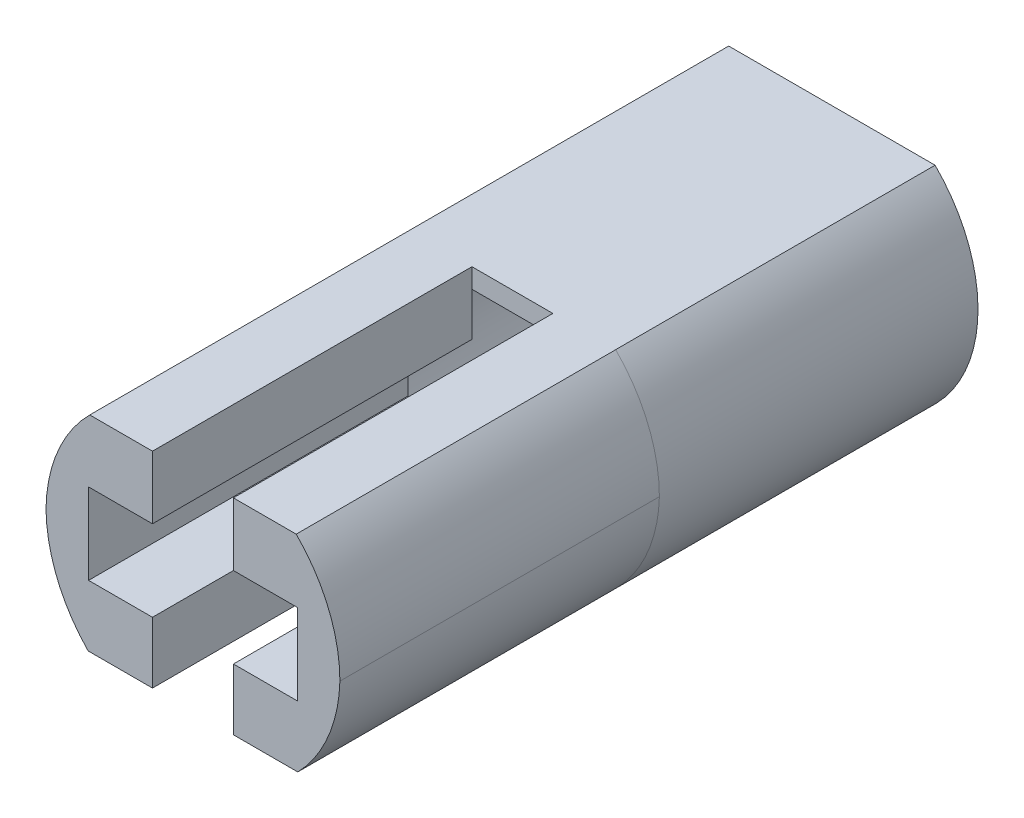
ISO-10303-21;
HEADER;
FILE_DESCRIPTION(('STEP AP214'),'2;1');
FILE_NAME('part.step','',(''),(''),'','','');
FILE_SCHEMA(('AUTOMOTIVE_DESIGN { 1 0 10303 214 1 1 1 1 }'));
ENDSEC;
DATA;
#1=APPLICATION_CONTEXT('core data for automotive mechanical design processes');
#2=APPLICATION_PROTOCOL_DEFINITION('international standard','automotive_design',2000,#1);
#3=PRODUCT_CONTEXT('',#1,'mechanical');
#4=PRODUCT('Part','Part','',(#3));
#5=PRODUCT_RELATED_PRODUCT_CATEGORY('part','',(#4));
#6=PRODUCT_DEFINITION_FORMATION('','',#4);
#7=PRODUCT_DEFINITION_CONTEXT('part definition',#1,'design');
#8=PRODUCT_DEFINITION('design','',#6,#7);
#9=PRODUCT_DEFINITION_SHAPE('','',#8);
#10=(LENGTH_UNIT() NAMED_UNIT(*) SI_UNIT(.MILLI.,.METRE.));
#11=(NAMED_UNIT(*) PLANE_ANGLE_UNIT() SI_UNIT($,.RADIAN.));
#12=(NAMED_UNIT(*) SI_UNIT($,.STERADIAN.) SOLID_ANGLE_UNIT());
#13=UNCERTAINTY_MEASURE_WITH_UNIT(LENGTH_MEASURE(1.E-05),#10,'distance_accuracy_value','');
#14=(GEOMETRIC_REPRESENTATION_CONTEXT(3) GLOBAL_UNCERTAINTY_ASSIGNED_CONTEXT((#13)) GLOBAL_UNIT_ASSIGNED_CONTEXT((#10,
#11,#12)) REPRESENTATION_CONTEXT('',''));
#15=CARTESIAN_POINT('',(0.,0.,0.));
#16=DIRECTION('',(0.,0.,1.));
#17=DIRECTION('',(1.,0.,0.));
#18=AXIS2_PLACEMENT_3D('',#15,#16,#17);
#19=CARTESIAN_POINT('',(0.,0.,7.5));
#20=DIRECTION('',(0.,0.,-1.));
#21=DIRECTION('',(-1.,0.,0.));
#22=AXIS2_PLACEMENT_3D('',#19,#20,#21);
#23=PLANE('',#22);
#24=CARTESIAN_POINT('',(3.4,3.40142886309282,7.5));
#25=DIRECTION('',(0.,0.,-1.));
#26=DIRECTION('',(-1.,0.,0.));
#27=AXIS2_PLACEMENT_3D('',#24,#25,#26);
#28=CIRCLE('',#27,3.5);
#29=CARTESIAN_POINT('',(6.9,3.40142886309282,7.5));
#30=VERTEX_POINT('',#29);
#31=CARTESIAN_POINT('',(5.87422905852766,5.87694710498427,7.5));
#32=VERTEX_POINT('',#31);
#33=EDGE_CURVE('E265',#30,#32,#28,.F.);
#34=ORIENTED_EDGE('',*,*,#33,.T.);
#35=DIRECTION('',(-1.,0.,0.));
#36=VECTOR('',#35,1.);
#37=CARTESIAN_POINT('',(3.45526077848229,5.87694710498427,7.5));
#38=LINE('',#37,#36);
#39=CARTESIAN_POINT('',(4.4,5.87694710498427,7.5));
#40=VERTEX_POINT('',#39);
#41=EDGE_CURVE('E316',#32,#40,#38,.T.);
#42=ORIENTED_EDGE('',*,*,#41,.T.);
#43=DIRECTION('',(0.,1.,0.));
#44=VECTOR('',#43,1.);
#45=CARTESIAN_POINT('',(4.4,5.9,7.5));
#46=LINE('',#45,#44);
#47=CARTESIAN_POINT('',(4.4,4.4,7.5));
#48=VERTEX_POINT('',#47);
#49=EDGE_CURVE('E386',#48,#40,#46,.T.);
#50=ORIENTED_EDGE('',*,*,#49,.F.);
#51=DIRECTION('',(-1.,0.,0.));
#52=VECTOR('',#51,1.);
#53=CARTESIAN_POINT('',(4.4,4.4,7.5));
#54=LINE('',#53,#52);
#55=CARTESIAN_POINT('',(5.9,4.4,7.5));
#56=VERTEX_POINT('',#55);
#57=EDGE_CURVE('E384',#56,#48,#54,.T.);
#58=ORIENTED_EDGE('',*,*,#57,.F.);
#59=DIRECTION('',(0.,1.,0.));
#60=VECTOR('',#59,1.);
#61=CARTESIAN_POINT('',(5.9,2.5,7.5));
#62=LINE('',#61,#60);
#63=CARTESIAN_POINT('',(5.9,2.5,7.5));
#64=VERTEX_POINT('',#63);
#65=EDGE_CURVE('E376',#64,#56,#62,.T.);
#66=ORIENTED_EDGE('',*,*,#65,.F.);
#67=DIRECTION('',(1.,0.,0.));
#68=VECTOR('',#67,1.);
#69=CARTESIAN_POINT('',(4.4,2.5,7.5));
#70=LINE('',#69,#68);
#71=CARTESIAN_POINT('',(4.4,2.5,7.5));
#72=VERTEX_POINT('',#71);
#73=EDGE_CURVE('E370',#72,#64,#70,.T.);
#74=ORIENTED_EDGE('',*,*,#73,.F.);
#75=DIRECTION('',(0.,1.,0.));
#76=VECTOR('',#75,1.);
#77=CARTESIAN_POINT('',(4.4,1.,7.5));
#78=LINE('',#77,#76);
#79=CARTESIAN_POINT('',(4.4,1.06,7.5));
#80=VERTEX_POINT('',#79);
#81=EDGE_CURVE('E368',#80,#72,#78,.T.);
#82=ORIENTED_EDGE('',*,*,#81,.F.);
#83=DIRECTION('',(1.,0.,0.));
#84=VECTOR('',#83,1.);
#85=CARTESIAN_POINT('',(0.,1.06,7.5));
#86=LINE('',#85,#84);
#87=CARTESIAN_POINT('',(5.91065115373723,1.06,7.5));
#88=VERTEX_POINT('',#87);
#89=EDGE_CURVE('E303',#80,#88,#86,.T.);
#90=ORIENTED_EDGE('',*,*,#89,.T.);
#91=CARTESIAN_POINT('',(3.40138831377805,3.5,7.5));
#92=DIRECTION('',(0.,0.,-1.));
#93=DIRECTION('',(-1.,0.,0.));
#94=AXIS2_PLACEMENT_3D('',#91,#92,#93);
#95=CIRCLE('',#94,3.5);
#96=EDGE_CURVE('E264',#88,#30,#95,.F.);
#97=ORIENTED_EDGE('',*,*,#96,.T.);
#98=EDGE_LOOP('',(#34,#42,#50,#58,#66,#74,#82,#90,#97));
#99=FACE_BOUND('',#98,.T.);
#100=ADVANCED_FACE('F33',(#99),#23,.F.);
#101=CARTESIAN_POINT('',(3.45,3.44930527176794,-7.5));
#102=DIRECTION('',(0.,0.,1.));
#103=DIRECTION('',(1.,0.,0.));
#104=AXIS2_PLACEMENT_3D('',#101,#102,#103);
#105=CYLINDRICAL_SURFACE('',#104,3.4297788505925);
#106=DIRECTION('',(0.,0.,1.));
#107=VECTOR('',#106,1.);
#108=CARTESIAN_POINT('',(5.87279551212843,5.87694710498427,-7.5));
#109=LINE('',#108,#107);
#110=CARTESIAN_POINT('',(5.87279551212843,5.87694710498427,0.));
#111=VERTEX_POINT('',#110);
#112=CARTESIAN_POINT('',(5.87279551212843,5.87694710498427,-7.5));
#113=VERTEX_POINT('',#112);
#114=EDGE_CURVE('E213',#111,#113,#109,.F.);
#115=ORIENTED_EDGE('',*,*,#114,.F.);
#116=CARTESIAN_POINT('',(3.45,3.44930527176794,0.));
#117=DIRECTION('',(0.,0.,1.));
#118=DIRECTION('',(1.,0.,0.));
#119=AXIS2_PLACEMENT_3D('',#116,#117,#118);
#120=CIRCLE('',#119,3.4297788505925);
#121=CARTESIAN_POINT('',(5.91063075062364,1.06,0.));
#122=VERTEX_POINT('',#121);
#123=EDGE_CURVE('E254',#122,#111,#120,.T.);
#124=ORIENTED_EDGE('',*,*,#123,.F.);
#125=DIRECTION('',(0.,0.,1.));
#126=VECTOR('',#125,1.);
#127=CARTESIAN_POINT('',(5.91061034751005,1.06,-7.5));
#128=LINE('',#127,#126);
#129=CARTESIAN_POINT('',(5.91061034751005,1.06,-7.5));
#130=VERTEX_POINT('',#129);
#131=EDGE_CURVE('E234',#130,#122,#128,.T.);
#132=ORIENTED_EDGE('',*,*,#131,.F.);
#133=CARTESIAN_POINT('',(3.45,3.44930527176794,-7.5));
#134=DIRECTION('',(0.,0.,1.));
#135=DIRECTION('',(1.,0.,0.));
#136=AXIS2_PLACEMENT_3D('',#133,#134,#135);
#137=CIRCLE('',#136,3.4297788505925);
#138=EDGE_CURVE('E229',#130,#113,#137,.T.);
#139=ORIENTED_EDGE('',*,*,#138,.T.);
#140=EDGE_LOOP('',(#115,#124,#132,#139));
#141=FACE_BOUND('',#140,.T.);
#142=ADVANCED_FACE('F233',(#141),#105,.T.);
#143=CARTESIAN_POINT('',(0.,0.,0.));
#144=DIRECTION('',(0.,0.,-1.));
#145=DIRECTION('',(-1.,0.,0.));
#146=AXIS2_PLACEMENT_3D('',#143,#144,#145);
#147=PLANE('',#146);
#148=DIRECTION('',(1.,0.,0.));
#149=VECTOR('',#148,1.);
#150=CARTESIAN_POINT('',(5.51038370012373,1.48021436267703,0.));
#151=LINE('',#150,#149);
#152=CARTESIAN_POINT('',(4.4,1.48021436267703,0.));
#153=VERTEX_POINT('',#152);
#154=CARTESIAN_POINT('',(5.51038370012373,1.48021436267703,0.));
#155=VERTEX_POINT('',#154);
#156=EDGE_CURVE('E259',#153,#155,#151,.T.);
#157=ORIENTED_EDGE('',*,*,#156,.F.);
#158=DIRECTION('',(0.,1.,0.));
#159=VECTOR('',#158,1.);
#160=CARTESIAN_POINT('',(4.4,1.,0.));
#161=LINE('',#160,#159);
#162=CARTESIAN_POINT('',(4.4,2.5,0.));
#163=VERTEX_POINT('',#162);
#164=EDGE_CURVE('E402',#153,#163,#161,.T.);
#165=ORIENTED_EDGE('',*,*,#164,.T.);
#166=DIRECTION('',(1.,0.,0.));
#167=VECTOR('',#166,1.);
#168=CARTESIAN_POINT('',(4.4,2.5,0.));
#169=LINE('',#168,#167);
#170=CARTESIAN_POINT('',(5.9,2.5,0.));
#171=VERTEX_POINT('',#170);
#172=EDGE_CURVE('E405',#163,#171,#169,.T.);
#173=ORIENTED_EDGE('',*,*,#172,.T.);
#174=DIRECTION('',(0.,1.,0.));
#175=VECTOR('',#174,1.);
#176=CARTESIAN_POINT('',(5.9,2.5,0.));
#177=LINE('',#176,#175);
#178=CARTESIAN_POINT('',(5.9,4.4,0.));
#179=VERTEX_POINT('',#178);
#180=EDGE_CURVE('E408',#171,#179,#177,.T.);
#181=ORIENTED_EDGE('',*,*,#180,.T.);
#182=DIRECTION('',(-1.,0.,0.));
#183=VECTOR('',#182,1.);
#184=CARTESIAN_POINT('',(4.4,4.4,0.));
#185=LINE('',#184,#183);
#186=CARTESIAN_POINT('',(4.4,4.4,0.));
#187=VERTEX_POINT('',#186);
#188=EDGE_CURVE('E411',#179,#187,#185,.T.);
#189=ORIENTED_EDGE('',*,*,#188,.T.);
#190=DIRECTION('',(0.,1.,0.));
#191=VECTOR('',#190,1.);
#192=CARTESIAN_POINT('',(4.4,5.9,0.));
#193=LINE('',#192,#191);
#194=CARTESIAN_POINT('',(4.4,5.41839618085885,0.));
#195=VERTEX_POINT('',#194);
#196=EDGE_CURVE('E415',#187,#195,#193,.T.);
#197=ORIENTED_EDGE('',*,*,#196,.T.);
#198=DIRECTION('',(-1.,0.,0.));
#199=VECTOR('',#198,1.);
#200=CARTESIAN_POINT('',(5.51038370012373,5.41839618085885,0.));
#201=LINE('',#200,#199);
#202=CARTESIAN_POINT('',(5.51038370012373,5.41839618085885,0.));
#203=VERTEX_POINT('',#202);
#204=EDGE_CURVE('E452',#203,#195,#201,.T.);
#205=ORIENTED_EDGE('',*,*,#204,.F.);
#206=CARTESIAN_POINT('',(3.45,3.44930527176794,0.));
#207=DIRECTION('',(0.,0.,1.));
#208=DIRECTION('',(1.,0.,0.));
#209=AXIS2_PLACEMENT_3D('',#206,#207,#208);
#210=CIRCLE('',#209,2.85);
#211=EDGE_CURVE('E295',#155,#203,#210,.T.);
#212=ORIENTED_EDGE('',*,*,#211,.F.);
#213=EDGE_LOOP('',(#157,#165,#173,#181,#189,#197,#205,#212));
#214=FACE_BOUND('',#213,.T.);
#215=ADVANCED_FACE('F496',(#214),#147,.T.);
#216=CARTESIAN_POINT('',(1.38961629987627,1.48021436267703,0.));
#217=VERTEX_POINT('',#216);
#218=CARTESIAN_POINT('',(2.5,1.48021436267703,0.));
#219=VERTEX_POINT('',#218);
#220=EDGE_CURVE('E456',#217,#219,#151,.T.);
#221=ORIENTED_EDGE('',*,*,#220,.F.);
#222=CARTESIAN_POINT('',(3.45,3.44930527176794,0.));
#223=DIRECTION('',(0.,0.,1.));
#224=DIRECTION('',(1.,0.,0.));
#225=AXIS2_PLACEMENT_3D('',#222,#223,#224);
#226=CIRCLE('',#225,2.85);
#227=CARTESIAN_POINT('',(1.38961629987628,5.41839618085885,0.));
#228=VERTEX_POINT('',#227);
#229=EDGE_CURVE('E447',#228,#217,#226,.T.);
#230=ORIENTED_EDGE('',*,*,#229,.F.);
#231=CARTESIAN_POINT('',(2.5,5.41839618085885,0.));
#232=VERTEX_POINT('',#231);
#233=EDGE_CURVE('E256',#232,#228,#201,.T.);
#234=ORIENTED_EDGE('',*,*,#233,.F.);
#235=DIRECTION('',(0.,-1.,0.));
#236=VECTOR('',#235,1.);
#237=CARTESIAN_POINT('',(2.5,4.4,0.));
#238=LINE('',#237,#236);
#239=CARTESIAN_POINT('',(2.5,4.4,0.));
#240=VERTEX_POINT('',#239);
#241=EDGE_CURVE('E235',#232,#240,#238,.T.);
#242=ORIENTED_EDGE('',*,*,#241,.T.);
#243=DIRECTION('',(-1.,0.,0.));
#244=VECTOR('',#243,1.);
#245=CARTESIAN_POINT('',(1.,4.4,0.));
#246=LINE('',#245,#244);
#247=CARTESIAN_POINT('',(1.,4.4,0.));
#248=VERTEX_POINT('',#247);
#249=EDGE_CURVE('E389',#240,#248,#246,.T.);
#250=ORIENTED_EDGE('',*,*,#249,.T.);
#251=DIRECTION('',(0.,-1.,0.));
#252=VECTOR('',#251,1.);
#253=CARTESIAN_POINT('',(1.,2.5,0.));
#254=LINE('',#253,#252);
#255=CARTESIAN_POINT('',(1.,2.5,0.));
#256=VERTEX_POINT('',#255);
#257=EDGE_CURVE('E392',#248,#256,#254,.T.);
#258=ORIENTED_EDGE('',*,*,#257,.T.);
#259=DIRECTION('',(1.,0.,0.));
#260=VECTOR('',#259,1.);
#261=CARTESIAN_POINT('',(1.,2.5,0.));
#262=LINE('',#261,#260);
#263=CARTESIAN_POINT('',(2.5,2.5,0.));
#264=VERTEX_POINT('',#263);
#265=EDGE_CURVE('E395',#256,#264,#262,.T.);
#266=ORIENTED_EDGE('',*,*,#265,.T.);
#267=DIRECTION('',(0.,-1.,0.));
#268=VECTOR('',#267,1.);
#269=CARTESIAN_POINT('',(2.5,1.,0.));
#270=LINE('',#269,#268);
#271=EDGE_CURVE('E399',#264,#219,#270,.T.);
#272=ORIENTED_EDGE('',*,*,#271,.T.);
#273=EDGE_LOOP('',(#221,#230,#234,#242,#250,#258,#266,#272));
#274=FACE_BOUND('',#273,.T.);
#275=ADVANCED_FACE('F443',(#274),#147,.T.);
#276=CARTESIAN_POINT('',(3.5,3.4,0.));
#277=DIRECTION('',(0.,0.,-1.));
#278=DIRECTION('',(-1.,0.,0.));
#279=AXIS2_PLACEMENT_3D('',#276,#277,#278);
#280=CIRCLE('',#279,3.5);
#281=CARTESIAN_POINT('',(0.000347304349202458,3.44930527176794,0.));
#282=VERTEX_POINT('',#281);
#283=CARTESIAN_POINT('',(1.00787331912706,5.85749966561162,0.));
#284=VERTEX_POINT('',#283);
#285=EDGE_CURVE('E337',#282,#284,#280,.T.);
#286=ORIENTED_EDGE('',*,*,#285,.T.);
#287=CARTESIAN_POINT('',(0.989389652489952,1.06,0.));
#288=VERTEX_POINT('',#287);
#289=EDGE_CURVE('E239',#284,#288,#120,.T.);
#290=ORIENTED_EDGE('',*,*,#289,.T.);
#291=CARTESIAN_POINT('',(3.5,3.49861054353589,0.));
#292=DIRECTION('',(0.,0.,-1.));
#293=DIRECTION('',(-1.,0.,0.));
#294=AXIS2_PLACEMENT_3D('',#291,#292,#293);
#295=CIRCLE('',#294,3.5);
#296=EDGE_CURVE('E273',#288,#282,#295,.T.);
#297=ORIENTED_EDGE('',*,*,#296,.T.);
#298=EDGE_LOOP('',(#286,#290,#297));
#299=FACE_BOUND('',#298,.T.);
#300=ADVANCED_FACE('F539',(#299),#147,.T.);
#301=DIRECTION('',(0.,-1.,0.));
#302=VECTOR('',#301,1.);
#303=CARTESIAN_POINT('',(2.5,4.4,7.5));
#304=LINE('',#303,#302);
#305=CARTESIAN_POINT('',(2.5,5.87694710498427,7.5));
#306=VERTEX_POINT('',#305);
#307=CARTESIAN_POINT('',(2.5,4.4,7.5));
#308=VERTEX_POINT('',#307);
#309=EDGE_CURVE('E246',#306,#308,#304,.T.);
#310=ORIENTED_EDGE('',*,*,#309,.F.);
#311=CARTESIAN_POINT('',(1.02720137513989,5.87694710498427,7.5));
#312=VERTEX_POINT('',#311);
#313=EDGE_CURVE('E230',#306,#312,#38,.T.);
#314=ORIENTED_EDGE('',*,*,#313,.T.);
#315=CARTESIAN_POINT('',(3.5,3.4,7.5));
#316=DIRECTION('',(0.,0.,-1.));
#317=DIRECTION('',(-1.,0.,0.));
#318=AXIS2_PLACEMENT_3D('',#315,#316,#317);
#319=CIRCLE('',#318,3.5);
#320=CARTESIAN_POINT('',(0.000347304349202458,3.44930527176794,7.5));
#321=VERTEX_POINT('',#320);
#322=EDGE_CURVE('E326',#312,#321,#319,.F.);
#323=ORIENTED_EDGE('',*,*,#322,.T.);
#324=CARTESIAN_POINT('',(3.5,3.49861054353589,7.5));
#325=DIRECTION('',(0.,0.,-1.));
#326=DIRECTION('',(-1.,0.,0.));
#327=AXIS2_PLACEMENT_3D('',#324,#325,#326);
#328=CIRCLE('',#327,3.5);
#329=CARTESIAN_POINT('',(0.989386804592229,1.06,7.5));
#330=VERTEX_POINT('',#329);
#331=EDGE_CURVE('E266',#321,#330,#328,.F.);
#332=ORIENTED_EDGE('',*,*,#331,.T.);
#333=CARTESIAN_POINT('',(2.5,1.06,7.5));
#334=VERTEX_POINT('',#333);
#335=EDGE_CURVE('E298',#330,#334,#86,.T.);
#336=ORIENTED_EDGE('',*,*,#335,.T.);
#337=DIRECTION('',(0.,-1.,0.));
#338=VECTOR('',#337,1.);
#339=CARTESIAN_POINT('',(2.5,1.,7.5));
#340=LINE('',#339,#338);
#341=CARTESIAN_POINT('',(2.5,2.5,7.5));
#342=VERTEX_POINT('',#341);
#343=EDGE_CURVE('E374',#342,#334,#340,.T.);
#344=ORIENTED_EDGE('',*,*,#343,.F.);
#345=DIRECTION('',(1.,0.,0.));
#346=VECTOR('',#345,1.);
#347=CARTESIAN_POINT('',(1.,2.5,7.5));
#348=LINE('',#347,#346);
#349=CARTESIAN_POINT('',(1.,2.5,7.5));
#350=VERTEX_POINT('',#349);
#351=EDGE_CURVE('E379',#350,#342,#348,.T.);
#352=ORIENTED_EDGE('',*,*,#351,.F.);
#353=DIRECTION('',(0.,-1.,0.));
#354=VECTOR('',#353,1.);
#355=CARTESIAN_POINT('',(1.,2.5,7.5));
#356=LINE('',#355,#354);
#357=CARTESIAN_POINT('',(1.,4.4,7.5));
#358=VERTEX_POINT('',#357);
#359=EDGE_CURVE('E782',#358,#350,#356,.T.);
#360=ORIENTED_EDGE('',*,*,#359,.F.);
#361=DIRECTION('',(-1.,0.,0.));
#362=VECTOR('',#361,1.);
#363=CARTESIAN_POINT('',(1.,4.4,7.5));
#364=LINE('',#363,#362);
#365=EDGE_CURVE('E789',#308,#358,#364,.T.);
#366=ORIENTED_EDGE('',*,*,#365,.F.);
#367=EDGE_LOOP('',(#310,#314,#323,#332,#336,#344,#352,#360,#366));
#368=FACE_BOUND('',#367,.T.);
#369=ADVANCED_FACE('F324',(#368),#23,.F.);
#370=DIRECTION('',(-1.,0.,0.));
#371=VECTOR('',#370,1.);
#372=CARTESIAN_POINT('',(0.,5.87694710498427,0.));
#373=LINE('',#372,#371);
#374=CARTESIAN_POINT('',(5.87422905852766,5.87694710498427,0.));
#375=VERTEX_POINT('',#374);
#376=EDGE_CURVE('E218',#375,#111,#373,.T.);
#377=ORIENTED_EDGE('',*,*,#376,.F.);
#378=CARTESIAN_POINT('',(3.4,3.40142886309282,0.));
#379=DIRECTION('',(0.,0.,-1.));
#380=DIRECTION('',(-1.,0.,0.));
#381=AXIS2_PLACEMENT_3D('',#378,#379,#380);
#382=CIRCLE('',#381,3.5);
#383=CARTESIAN_POINT('',(6.9,3.40142886309282,0.));
#384=VERTEX_POINT('',#383);
#385=EDGE_CURVE('E336',#375,#384,#382,.T.);
#386=ORIENTED_EDGE('',*,*,#385,.T.);
#387=CARTESIAN_POINT('',(3.40138831377805,3.5,0.));
#388=DIRECTION('',(0.,0.,-1.));
#389=DIRECTION('',(-1.,0.,0.));
#390=AXIS2_PLACEMENT_3D('',#387,#388,#389);
#391=CIRCLE('',#390,3.5);
#392=EDGE_CURVE('E260',#384,#122,#391,.T.);
#393=ORIENTED_EDGE('',*,*,#392,.T.);
#394=ORIENTED_EDGE('',*,*,#123,.T.);
#395=EDGE_LOOP('',(#377,#386,#393,#394));
#396=FACE_BOUND('',#395,.T.);
#397=ADVANCED_FACE('F360',(#396),#147,.T.);
#398=CARTESIAN_POINT('',(2.5,4.4,7.5));
#399=DIRECTION('',(1.,0.,0.));
#400=DIRECTION('',(0.,0.,-1.));
#401=AXIS2_PLACEMENT_3D('',#398,#399,#400);
#402=PLANE('',#401);
#403=DIRECTION('',(0.,0.,-1.));
#404=VECTOR('',#403,1.);
#405=CARTESIAN_POINT('',(2.5,5.87694710498427,7.5));
#406=LINE('',#405,#404);
#407=CARTESIAN_POINT('',(2.5,5.87694710498427,0.));
#408=VERTEX_POINT('',#407);
#409=EDGE_CURVE('E49',#306,#408,#406,.T.);
#410=ORIENTED_EDGE('',*,*,#409,.F.);
#411=ORIENTED_EDGE('',*,*,#309,.T.);
#412=DIRECTION('',(0.,0.,-1.));
#413=VECTOR('',#412,1.);
#414=CARTESIAN_POINT('',(2.5,4.4,7.5));
#415=LINE('',#414,#413);
#416=EDGE_CURVE('E342',#308,#240,#415,.T.);
#417=ORIENTED_EDGE('',*,*,#416,.T.);
#418=ORIENTED_EDGE('',*,*,#241,.F.);
#419=EDGE_CURVE('E237',#408,#232,#238,.T.);
#420=ORIENTED_EDGE('',*,*,#419,.F.);
#421=EDGE_LOOP('',(#410,#411,#417,#418,#420));
#422=FACE_BOUND('',#421,.T.);
#423=ADVANCED_FACE('F435',(#422),#402,.T.);
#424=CARTESIAN_POINT('',(1.,4.4,7.5));
#425=DIRECTION('',(0.,-1.,0.));
#426=DIRECTION('',(0.,0.,-1.));
#427=AXIS2_PLACEMENT_3D('',#424,#425,#426);
#428=PLANE('',#427);
#429=ORIENTED_EDGE('',*,*,#249,.F.);
#430=ORIENTED_EDGE('',*,*,#416,.F.);
#431=ORIENTED_EDGE('',*,*,#365,.T.);
#432=DIRECTION('',(0.,0.,-1.));
#433=VECTOR('',#432,1.);
#434=CARTESIAN_POINT('',(1.,4.4,7.5));
#435=LINE('',#434,#433);
#436=EDGE_CURVE('E429',#358,#248,#435,.T.);
#437=ORIENTED_EDGE('',*,*,#436,.T.);
#438=EDGE_LOOP('',(#429,#430,#431,#437));
#439=FACE_BOUND('',#438,.T.);
#440=ADVANCED_FACE('F439',(#439),#428,.T.);
#441=CARTESIAN_POINT('',(1.,2.5,7.5));
#442=DIRECTION('',(1.,0.,0.));
#443=DIRECTION('',(0.,0.,-1.));
#444=AXIS2_PLACEMENT_3D('',#441,#442,#443);
#445=PLANE('',#444);
#446=ORIENTED_EDGE('',*,*,#257,.F.);
#447=ORIENTED_EDGE('',*,*,#436,.F.);
#448=ORIENTED_EDGE('',*,*,#359,.T.);
#449=DIRECTION('',(0.,0.,-1.));
#450=VECTOR('',#449,1.);
#451=CARTESIAN_POINT('',(1.,2.5,7.5));
#452=LINE('',#451,#450);
#453=EDGE_CURVE('E427',#350,#256,#452,.T.);
#454=ORIENTED_EDGE('',*,*,#453,.T.);
#455=EDGE_LOOP('',(#446,#447,#448,#454));
#456=FACE_BOUND('',#455,.T.);
#457=ADVANCED_FACE('F585',(#456),#445,.T.);
#458=CARTESIAN_POINT('',(1.,2.5,7.5));
#459=DIRECTION('',(0.,1.,0.));
#460=DIRECTION('',(0.,0.,1.));
#461=AXIS2_PLACEMENT_3D('',#458,#459,#460);
#462=PLANE('',#461);
#463=ORIENTED_EDGE('',*,*,#265,.F.);
#464=ORIENTED_EDGE('',*,*,#453,.F.);
#465=ORIENTED_EDGE('',*,*,#351,.T.);
#466=DIRECTION('',(0.,0.,-1.));
#467=VECTOR('',#466,1.);
#468=CARTESIAN_POINT('',(2.5,2.5,7.5));
#469=LINE('',#468,#467);
#470=EDGE_CURVE('E425',#342,#264,#469,.T.);
#471=ORIENTED_EDGE('',*,*,#470,.T.);
#472=EDGE_LOOP('',(#463,#464,#465,#471));
#473=FACE_BOUND('',#472,.T.);
#474=ADVANCED_FACE('F581',(#473),#462,.T.);
#475=CARTESIAN_POINT('',(2.5,1.,7.5));
#476=DIRECTION('',(1.,0.,0.));
#477=DIRECTION('',(0.,0.,-1.));
#478=AXIS2_PLACEMENT_3D('',#475,#476,#477);
#479=PLANE('',#478);
#480=DIRECTION('',(0.,0.,1.));
#481=VECTOR('',#480,1.);
#482=CARTESIAN_POINT('',(2.5,1.06,7.5));
#483=LINE('',#482,#481);
#484=CARTESIAN_POINT('',(2.5,1.06,0.));
#485=VERTEX_POINT('',#484);
#486=EDGE_CURVE('E293',#485,#334,#483,.T.);
#487=ORIENTED_EDGE('',*,*,#486,.F.);
#488=EDGE_CURVE('E398',#219,#485,#270,.T.);
#489=ORIENTED_EDGE('',*,*,#488,.F.);
#490=ORIENTED_EDGE('',*,*,#271,.F.);
#491=ORIENTED_EDGE('',*,*,#470,.F.);
#492=ORIENTED_EDGE('',*,*,#343,.T.);
#493=EDGE_LOOP('',(#487,#489,#490,#491,#492));
#494=FACE_BOUND('',#493,.T.);
#495=ADVANCED_FACE('F578',(#494),#479,.T.);
#496=CARTESIAN_POINT('',(4.4,1.,7.5));
#497=DIRECTION('',(-1.,0.,0.));
#498=DIRECTION('',(0.,0.,1.));
#499=AXIS2_PLACEMENT_3D('',#496,#497,#498);
#500=PLANE('',#499);
#501=DIRECTION('',(0.,0.,-1.));
#502=VECTOR('',#501,1.);
#503=CARTESIAN_POINT('',(4.4,1.06,7.5));
#504=LINE('',#503,#502);
#505=CARTESIAN_POINT('',(4.4,1.06,0.));
#506=VERTEX_POINT('',#505);
#507=EDGE_CURVE('E291',#80,#506,#504,.T.);
#508=ORIENTED_EDGE('',*,*,#507,.F.);
#509=ORIENTED_EDGE('',*,*,#81,.T.);
#510=DIRECTION('',(0.,0.,-1.));
#511=VECTOR('',#510,1.);
#512=CARTESIAN_POINT('',(4.4,2.5,7.5));
#513=LINE('',#512,#511);
#514=EDGE_CURVE('E423',#72,#163,#513,.T.);
#515=ORIENTED_EDGE('',*,*,#514,.T.);
#516=ORIENTED_EDGE('',*,*,#164,.F.);
#517=EDGE_CURVE('E403',#506,#153,#161,.T.);
#518=ORIENTED_EDGE('',*,*,#517,.F.);
#519=EDGE_LOOP('',(#508,#509,#515,#516,#518));
#520=FACE_BOUND('',#519,.T.);
#521=ADVANCED_FACE('F498',(#520),#500,.T.);
#522=CARTESIAN_POINT('',(4.4,2.5,7.5));
#523=DIRECTION('',(0.,1.,0.));
#524=DIRECTION('',(0.,0.,1.));
#525=AXIS2_PLACEMENT_3D('',#522,#523,#524);
#526=PLANE('',#525);
#527=ORIENTED_EDGE('',*,*,#172,.F.);
#528=ORIENTED_EDGE('',*,*,#514,.F.);
#529=ORIENTED_EDGE('',*,*,#73,.T.);
#530=DIRECTION('',(0.,0.,-1.));
#531=VECTOR('',#530,1.);
#532=CARTESIAN_POINT('',(5.9,2.5,7.5));
#533=LINE('',#532,#531);
#534=EDGE_CURVE('E421',#64,#171,#533,.T.);
#535=ORIENTED_EDGE('',*,*,#534,.T.);
#536=EDGE_LOOP('',(#527,#528,#529,#535));
#537=FACE_BOUND('',#536,.T.);
#538=ADVANCED_FACE('F501',(#537),#526,.T.);
#539=CARTESIAN_POINT('',(5.9,2.5,7.5));
#540=DIRECTION('',(-1.,0.,0.));
#541=DIRECTION('',(0.,-1.,0.));
#542=AXIS2_PLACEMENT_3D('',#539,#540,#541);
#543=PLANE('',#542);
#544=ORIENTED_EDGE('',*,*,#180,.F.);
#545=ORIENTED_EDGE('',*,*,#534,.F.);
#546=ORIENTED_EDGE('',*,*,#65,.T.);
#547=DIRECTION('',(0.,0.,-1.));
#548=VECTOR('',#547,1.);
#549=CARTESIAN_POINT('',(5.9,4.4,7.5));
#550=LINE('',#549,#548);
#551=EDGE_CURVE('E419',#56,#179,#550,.T.);
#552=ORIENTED_EDGE('',*,*,#551,.T.);
#553=EDGE_LOOP('',(#544,#545,#546,#552));
#554=FACE_BOUND('',#553,.T.);
#555=ADVANCED_FACE('F506',(#554),#543,.T.);
#556=CARTESIAN_POINT('',(4.4,4.4,7.5));
#557=DIRECTION('',(0.,-1.,0.));
#558=DIRECTION('',(0.,0.,-1.));
#559=AXIS2_PLACEMENT_3D('',#556,#557,#558);
#560=PLANE('',#559);
#561=ORIENTED_EDGE('',*,*,#188,.F.);
#562=ORIENTED_EDGE('',*,*,#551,.F.);
#563=ORIENTED_EDGE('',*,*,#57,.T.);
#564=DIRECTION('',(0.,0.,-1.));
#565=VECTOR('',#564,1.);
#566=CARTESIAN_POINT('',(4.4,4.4,7.5));
#567=LINE('',#566,#565);
#568=EDGE_CURVE('E387',#48,#187,#567,.T.);
#569=ORIENTED_EDGE('',*,*,#568,.T.);
#570=EDGE_LOOP('',(#561,#562,#563,#569));
#571=FACE_BOUND('',#570,.T.);
#572=ADVANCED_FACE('F510',(#571),#560,.T.);
#573=CARTESIAN_POINT('',(4.4,5.9,7.5));
#574=DIRECTION('',(-1.,0.,0.));
#575=DIRECTION('',(0.,0.,1.));
#576=AXIS2_PLACEMENT_3D('',#573,#574,#575);
#577=PLANE('',#576);
#578=DIRECTION('',(0.,0.,1.));
#579=VECTOR('',#578,1.);
#580=CARTESIAN_POINT('',(4.4,5.87694710498427,7.5));
#581=LINE('',#580,#579);
#582=CARTESIAN_POINT('',(4.4,5.87694710498427,0.));
#583=VERTEX_POINT('',#582);
#584=EDGE_CURVE('E315',#583,#40,#581,.T.);
#585=ORIENTED_EDGE('',*,*,#584,.F.);
#586=EDGE_CURVE('E414',#195,#583,#193,.T.);
#587=ORIENTED_EDGE('',*,*,#586,.F.);
#588=ORIENTED_EDGE('',*,*,#196,.F.);
#589=ORIENTED_EDGE('',*,*,#568,.F.);
#590=ORIENTED_EDGE('',*,*,#49,.T.);
#591=EDGE_LOOP('',(#585,#587,#588,#589,#590));
#592=FACE_BOUND('',#591,.T.);
#593=ADVANCED_FACE('F514',(#592),#577,.T.);
#594=CARTESIAN_POINT('',(3.5,3.4,7.5));
#595=DIRECTION('',(0.,0.,-1.));
#596=DIRECTION('',(-1.,0.,0.));
#597=AXIS2_PLACEMENT_3D('',#594,#595,#596);
#598=CYLINDRICAL_SURFACE('',#597,3.5);
#599=DIRECTION('',(0.,0.,-1.));
#600=VECTOR('',#599,1.);
#601=CARTESIAN_POINT('',(1.02720137513989,5.87694710498427,7.5));
#602=LINE('',#601,#600);
#603=CARTESIAN_POINT('',(1.02720448787157,5.87694710498427,0.));
#604=VERTEX_POINT('',#603);
#605=EDGE_CURVE('E223',#604,#312,#602,.F.);
#606=ORIENTED_EDGE('',*,*,#605,.F.);
#607=EDGE_CURVE('E257',#604,#284,#120,.T.);
#608=ORIENTED_EDGE('',*,*,#607,.T.);
#609=ORIENTED_EDGE('',*,*,#285,.F.);
#610=DIRECTION('',(0.,0.,-1.));
#611=VECTOR('',#610,1.);
#612=CARTESIAN_POINT('',(0.000347304349202458,3.44930527176794,3.75));
#613=LINE('',#612,#611);
#614=EDGE_CURVE('E275',#282,#321,#613,.F.);
#615=ORIENTED_EDGE('',*,*,#614,.T.);
#616=ORIENTED_EDGE('',*,*,#322,.F.);
#617=EDGE_LOOP('',(#606,#608,#609,#615,#616));
#618=FACE_BOUND('',#617,.T.);
#619=ADVANCED_FACE('F331',(#618),#598,.T.);
#620=CARTESIAN_POINT('',(3.4,3.40142886309282,7.5));
#621=DIRECTION('',(0.,0.,-1.));
#622=DIRECTION('',(-1.,0.,0.));
#623=AXIS2_PLACEMENT_3D('',#620,#621,#622);
#624=CYLINDRICAL_SURFACE('',#623,3.5);
#625=DIRECTION('',(0.,0.,-1.));
#626=VECTOR('',#625,1.);
#627=CARTESIAN_POINT('',(5.87422905852766,5.87694710498427,7.5));
#628=LINE('',#627,#626);
#629=EDGE_CURVE('E306',#32,#375,#628,.T.);
#630=ORIENTED_EDGE('',*,*,#629,.F.);
#631=ORIENTED_EDGE('',*,*,#33,.F.);
#632=DIRECTION('',(0.,0.,-1.));
#633=VECTOR('',#632,1.);
#634=CARTESIAN_POINT('',(6.9,3.40142886309282,7.5));
#635=LINE('',#634,#633);
#636=EDGE_CURVE('E339',#384,#30,#635,.F.);
#637=ORIENTED_EDGE('',*,*,#636,.F.);
#638=ORIENTED_EDGE('',*,*,#385,.F.);
#639=EDGE_LOOP('',(#630,#631,#637,#638));
#640=FACE_BOUND('',#639,.T.);
#641=ADVANCED_FACE('F357',(#640),#624,.T.);
#642=CARTESIAN_POINT('',(3.40138831377805,3.5,7.5));
#643=DIRECTION('',(0.,0.,-1.));
#644=DIRECTION('',(-1.,0.,0.));
#645=AXIS2_PLACEMENT_3D('',#642,#643,#644);
#646=CYLINDRICAL_SURFACE('',#645,3.5);
#647=DIRECTION('',(0.,0.,-1.));
#648=VECTOR('',#647,1.);
#649=CARTESIAN_POINT('',(5.91065115373723,1.06,7.5));
#650=LINE('',#649,#648);
#651=EDGE_CURVE('E284',#122,#88,#650,.F.);
#652=ORIENTED_EDGE('',*,*,#651,.F.);
#653=ORIENTED_EDGE('',*,*,#392,.F.);
#654=ORIENTED_EDGE('',*,*,#636,.T.);
#655=ORIENTED_EDGE('',*,*,#96,.F.);
#656=EDGE_LOOP('',(#652,#653,#654,#655));
#657=FACE_BOUND('',#656,.T.);
#658=ADVANCED_FACE('F362',(#657),#646,.T.);
#659=CARTESIAN_POINT('',(3.5,3.49861054353589,7.5));
#660=DIRECTION('',(0.,0.,-1.));
#661=DIRECTION('',(-1.,0.,0.));
#662=AXIS2_PLACEMENT_3D('',#659,#660,#661);
#663=CYLINDRICAL_SURFACE('',#662,3.5);
#664=DIRECTION('',(0.,0.,-1.));
#665=VECTOR('',#664,1.);
#666=CARTESIAN_POINT('',(0.989386804592229,1.06,7.5));
#667=LINE('',#666,#665);
#668=EDGE_CURVE('E277',#330,#288,#667,.T.);
#669=ORIENTED_EDGE('',*,*,#668,.F.);
#670=ORIENTED_EDGE('',*,*,#331,.F.);
#671=ORIENTED_EDGE('',*,*,#614,.F.);
#672=ORIENTED_EDGE('',*,*,#296,.F.);
#673=EDGE_LOOP('',(#669,#670,#671,#672));
#674=FACE_BOUND('',#673,.T.);
#675=ADVANCED_FACE('F35',(#674),#663,.T.);
#676=CARTESIAN_POINT('',(3.45,3.44930527176794,0.));
#677=DIRECTION('',(0.,0.,1.));
#678=DIRECTION('',(1.,0.,0.));
#679=AXIS2_PLACEMENT_3D('',#676,#677,#678);
#680=PLANE('',#679);
#681=DIRECTION('',(-1.,0.,0.));
#682=VECTOR('',#681,1.);
#683=CARTESIAN_POINT('',(3.45,1.06,0.));
#684=LINE('',#683,#682);
#685=EDGE_CURVE('E279',#506,#485,#684,.T.);
#686=ORIENTED_EDGE('',*,*,#685,.F.);
#687=ORIENTED_EDGE('',*,*,#517,.T.);
#688=EDGE_CURVE('E457',#219,#153,#151,.T.);
#689=ORIENTED_EDGE('',*,*,#688,.F.);
#690=ORIENTED_EDGE('',*,*,#488,.T.);
#691=EDGE_LOOP('',(#686,#687,#689,#690));
#692=FACE_BOUND('',#691,.T.);
#693=ADVANCED_FACE('F520',(#692),#680,.T.);
#694=DIRECTION('',(0.,0.,1.));
#695=VECTOR('',#694,1.);
#696=CARTESIAN_POINT('',(1.02720448787157,5.87694710498427,-7.5));
#697=LINE('',#696,#695);
#698=CARTESIAN_POINT('',(1.02720448787157,5.87694710498427,-7.5));
#699=VERTEX_POINT('',#698);
#700=EDGE_CURVE('E313',#699,#604,#697,.T.);
#701=ORIENTED_EDGE('',*,*,#700,.F.);
#702=CARTESIAN_POINT('',(0.989389652489952,1.06,-7.5));
#703=VERTEX_POINT('',#702);
#704=EDGE_CURVE('E57',#699,#703,#137,.T.);
#705=ORIENTED_EDGE('',*,*,#704,.T.);
#706=DIRECTION('',(0.,0.,1.));
#707=VECTOR('',#706,1.);
#708=CARTESIAN_POINT('',(0.989389652489952,1.06,-7.5));
#709=LINE('',#708,#707);
#710=EDGE_CURVE('E280',#288,#703,#709,.F.);
#711=ORIENTED_EDGE('',*,*,#710,.F.);
#712=ORIENTED_EDGE('',*,*,#289,.F.);
#713=ORIENTED_EDGE('',*,*,#607,.F.);
#714=EDGE_LOOP('',(#701,#705,#711,#712,#713));
#715=FACE_BOUND('',#714,.T.);
#716=ADVANCED_FACE('F526',(#715),#105,.T.);
#717=CARTESIAN_POINT('',(3.45,3.44930527176794,-7.5));
#718=DIRECTION('',(0.,0.,1.));
#719=DIRECTION('',(1.,0.,0.));
#720=AXIS2_PLACEMENT_3D('',#717,#718,#719);
#721=PLANE('',#720);
#722=DIRECTION('',(1.,0.,0.));
#723=VECTOR('',#722,1.);
#724=CARTESIAN_POINT('',(5.51038370012373,1.48021436267703,-7.5));
#725=LINE('',#724,#723);
#726=CARTESIAN_POINT('',(1.38961629987627,1.48021436267703,-7.5));
#727=VERTEX_POINT('',#726);
#728=CARTESIAN_POINT('',(5.51038370012373,1.48021436267703,-7.5));
#729=VERTEX_POINT('',#728);
#730=EDGE_CURVE('E467',#727,#729,#725,.T.);
#731=ORIENTED_EDGE('',*,*,#730,.T.);
#732=CARTESIAN_POINT('',(3.45,3.44930527176794,-7.5));
#733=DIRECTION('',(0.,0.,1.));
#734=DIRECTION('',(1.,0.,0.));
#735=AXIS2_PLACEMENT_3D('',#732,#733,#734);
#736=CIRCLE('',#735,2.85);
#737=CARTESIAN_POINT('',(5.51038370012373,5.41839618085885,-7.5));
#738=VERTEX_POINT('',#737);
#739=EDGE_CURVE('E299',#729,#738,#736,.T.);
#740=ORIENTED_EDGE('',*,*,#739,.T.);
#741=DIRECTION('',(-1.,0.,0.));
#742=VECTOR('',#741,1.);
#743=CARTESIAN_POINT('',(5.51038370012373,5.41839618085885,-7.5));
#744=LINE('',#743,#742);
#745=CARTESIAN_POINT('',(1.38961629987628,5.41839618085885,-7.5));
#746=VERTEX_POINT('',#745);
#747=EDGE_CURVE('E472',#738,#746,#744,.T.);
#748=ORIENTED_EDGE('',*,*,#747,.T.);
#749=CARTESIAN_POINT('',(3.45,3.44930527176794,-7.5));
#750=DIRECTION('',(0.,0.,1.));
#751=DIRECTION('',(1.,0.,0.));
#752=AXIS2_PLACEMENT_3D('',#749,#750,#751);
#753=CIRCLE('',#752,2.85);
#754=EDGE_CURVE('E470',#746,#727,#753,.T.);
#755=ORIENTED_EDGE('',*,*,#754,.T.);
#756=EDGE_LOOP('',(#731,#740,#748,#755));
#757=FACE_BOUND('',#756,.T.);
#758=ORIENTED_EDGE('',*,*,#704,.F.);
#759=DIRECTION('',(-1.,0.,0.));
#760=VECTOR('',#759,1.);
#761=CARTESIAN_POINT('',(3.45526077848229,5.87694710498427,-7.5));
#762=LINE('',#761,#760);
#763=EDGE_CURVE('E216',#113,#699,#762,.T.);
#764=ORIENTED_EDGE('',*,*,#763,.F.);
#765=ORIENTED_EDGE('',*,*,#138,.F.);
#766=DIRECTION('',(-1.,0.,0.));
#767=VECTOR('',#766,1.);
#768=CARTESIAN_POINT('',(3.45,1.06,-7.5));
#769=LINE('',#768,#767);
#770=EDGE_CURVE('E42',#130,#703,#769,.T.);
#771=ORIENTED_EDGE('',*,*,#770,.T.);
#772=EDGE_LOOP('',(#758,#764,#765,#771));
#773=FACE_BOUND('',#772,.T.);
#774=ADVANCED_FACE('F227',(#757,#773),#721,.F.);
#775=DIRECTION('',(1.,0.,0.));
#776=VECTOR('',#775,1.);
#777=CARTESIAN_POINT('',(3.45,5.87694710498427,0.));
#778=LINE('',#777,#776);
#779=EDGE_CURVE('E11',#408,#583,#778,.T.);
#780=ORIENTED_EDGE('',*,*,#779,.F.);
#781=ORIENTED_EDGE('',*,*,#419,.T.);
#782=EDGE_CURVE('E453',#195,#232,#201,.T.);
#783=ORIENTED_EDGE('',*,*,#782,.F.);
#784=ORIENTED_EDGE('',*,*,#586,.T.);
#785=EDGE_LOOP('',(#780,#781,#783,#784));
#786=FACE_BOUND('',#785,.T.);
#787=ADVANCED_FACE('F517',(#786),#680,.T.);
#788=CARTESIAN_POINT('',(3.45,3.44930527176794,-7.5));
#789=DIRECTION('',(0.,0.,1.));
#790=DIRECTION('',(1.,0.,0.));
#791=AXIS2_PLACEMENT_3D('',#788,#789,#790);
#792=CYLINDRICAL_SURFACE('',#791,2.85);
#793=ORIENTED_EDGE('',*,*,#211,.T.);
#794=DIRECTION('',(0.,0.,1.));
#795=VECTOR('',#794,1.);
#796=CARTESIAN_POINT('',(5.51038370012373,5.41839618085885,-7.5));
#797=LINE('',#796,#795);
#798=EDGE_CURVE('E242',#738,#203,#797,.T.);
#799=ORIENTED_EDGE('',*,*,#798,.F.);
#800=ORIENTED_EDGE('',*,*,#739,.F.);
#801=DIRECTION('',(0.,0.,1.));
#802=VECTOR('',#801,1.);
#803=CARTESIAN_POINT('',(5.51038370012373,1.48021436267703,-7.5));
#804=LINE('',#803,#802);
#805=EDGE_CURVE('E483',#729,#155,#804,.T.);
#806=ORIENTED_EDGE('',*,*,#805,.T.);
#807=EDGE_LOOP('',(#793,#799,#800,#806));
#808=FACE_BOUND('',#807,.T.);
#809=ADVANCED_FACE('F489',(#808),#792,.F.);
#810=CARTESIAN_POINT('',(5.51038370012373,1.48021436267703,-7.5));
#811=DIRECTION('',(0.,-1.,0.));
#812=DIRECTION('',(1.,0.,0.));
#813=AXIS2_PLACEMENT_3D('',#810,#811,#812);
#814=PLANE('',#813);
#815=ORIENTED_EDGE('',*,*,#220,.T.);
#816=ORIENTED_EDGE('',*,*,#688,.T.);
#817=ORIENTED_EDGE('',*,*,#156,.T.);
#818=ORIENTED_EDGE('',*,*,#805,.F.);
#819=ORIENTED_EDGE('',*,*,#730,.F.);
#820=DIRECTION('',(0.,0.,1.));
#821=VECTOR('',#820,1.);
#822=CARTESIAN_POINT('',(1.38961629987627,1.48021436267703,-7.5));
#823=LINE('',#822,#821);
#824=EDGE_CURVE('E485',#727,#217,#823,.T.);
#825=ORIENTED_EDGE('',*,*,#824,.T.);
#826=EDGE_LOOP('',(#815,#816,#817,#818,#819,#825));
#827=FACE_BOUND('',#826,.T.);
#828=ADVANCED_FACE('F491',(#827),#814,.F.);
#829=CARTESIAN_POINT('',(3.45,3.44930527176794,-7.5));
#830=DIRECTION('',(0.,0.,1.));
#831=DIRECTION('',(1.,0.,0.));
#832=AXIS2_PLACEMENT_3D('',#829,#830,#831);
#833=CYLINDRICAL_SURFACE('',#832,2.85);
#834=ORIENTED_EDGE('',*,*,#229,.T.);
#835=ORIENTED_EDGE('',*,*,#824,.F.);
#836=ORIENTED_EDGE('',*,*,#754,.F.);
#837=DIRECTION('',(0.,0.,1.));
#838=VECTOR('',#837,1.);
#839=CARTESIAN_POINT('',(1.38961629987628,5.41839618085885,-7.5));
#840=LINE('',#839,#838);
#841=EDGE_CURVE('E486',#746,#228,#840,.T.);
#842=ORIENTED_EDGE('',*,*,#841,.T.);
#843=EDGE_LOOP('',(#834,#835,#836,#842));
#844=FACE_BOUND('',#843,.T.);
#845=ADVANCED_FACE('F682',(#844),#833,.F.);
#846=CARTESIAN_POINT('',(5.51038370012373,5.41839618085885,-7.5));
#847=DIRECTION('',(0.,1.,0.));
#848=DIRECTION('',(0.,0.,1.));
#849=AXIS2_PLACEMENT_3D('',#846,#847,#848);
#850=PLANE('',#849);
#851=ORIENTED_EDGE('',*,*,#204,.T.);
#852=ORIENTED_EDGE('',*,*,#782,.T.);
#853=ORIENTED_EDGE('',*,*,#233,.T.);
#854=ORIENTED_EDGE('',*,*,#841,.F.);
#855=ORIENTED_EDGE('',*,*,#747,.F.);
#856=ORIENTED_EDGE('',*,*,#798,.T.);
#857=EDGE_LOOP('',(#851,#852,#853,#854,#855,#856));
#858=FACE_BOUND('',#857,.T.);
#859=ADVANCED_FACE('F488',(#858),#850,.F.);
#860=CARTESIAN_POINT('',(0.,1.06,7.5));
#861=DIRECTION('',(0.,1.,0.));
#862=DIRECTION('',(-1.,0.,0.));
#863=AXIS2_PLACEMENT_3D('',#860,#861,#862);
#864=PLANE('',#863);
#865=ORIENTED_EDGE('',*,*,#486,.T.);
#866=ORIENTED_EDGE('',*,*,#335,.F.);
#867=ORIENTED_EDGE('',*,*,#668,.T.);
#868=ORIENTED_EDGE('',*,*,#710,.T.);
#869=ORIENTED_EDGE('',*,*,#770,.F.);
#870=ORIENTED_EDGE('',*,*,#131,.T.);
#871=ORIENTED_EDGE('',*,*,#651,.T.);
#872=ORIENTED_EDGE('',*,*,#89,.F.);
#873=ORIENTED_EDGE('',*,*,#507,.T.);
#874=ORIENTED_EDGE('',*,*,#685,.T.);
#875=EDGE_LOOP('',(#865,#866,#867,#868,#869,#870,#871,#872,#873,#874));
#876=FACE_BOUND('',#875,.T.);
#877=ADVANCED_FACE('F364',(#876),#864,.F.);
#878=CARTESIAN_POINT('',(3.45526077848229,5.87694710498427,7.5));
#879=DIRECTION('',(0.,-1.,0.));
#880=DIRECTION('',(0.,0.,-1.));
#881=AXIS2_PLACEMENT_3D('',#878,#879,#880);
#882=PLANE('',#881);
#883=ORIENTED_EDGE('',*,*,#629,.T.);
#884=ORIENTED_EDGE('',*,*,#376,.T.);
#885=ORIENTED_EDGE('',*,*,#114,.T.);
#886=ORIENTED_EDGE('',*,*,#763,.T.);
#887=ORIENTED_EDGE('',*,*,#700,.T.);
#888=ORIENTED_EDGE('',*,*,#605,.T.);
#889=ORIENTED_EDGE('',*,*,#313,.F.);
#890=ORIENTED_EDGE('',*,*,#409,.T.);
#891=ORIENTED_EDGE('',*,*,#779,.T.);
#892=ORIENTED_EDGE('',*,*,#584,.T.);
#893=ORIENTED_EDGE('',*,*,#41,.F.);
#894=EDGE_LOOP('',(#883,#884,#885,#886,#887,#888,#889,#890,#891,#892,#893));
#895=FACE_BOUND('',#894,.T.);
#896=ADVANCED_FACE('F215',(#895),#882,.F.);
#897=CLOSED_SHELL('',(#100,#142,#215,#275,#300,#369,#397,#423,#440,#457,#474,#495,#521,#538,
#555,#572,#593,#619,#641,#658,#675,#693,#716,#774,#787,#809,#828,#845,#859,#877,#896));
#898=MANIFOLD_SOLID_BREP('B2',#897);
#899=ADVANCED_BREP_SHAPE_REPRESENTATION('',(#18,#898),#14);
#900=SHAPE_DEFINITION_REPRESENTATION(#9,#899);
ENDSEC;
END-ISO-10303-21;
